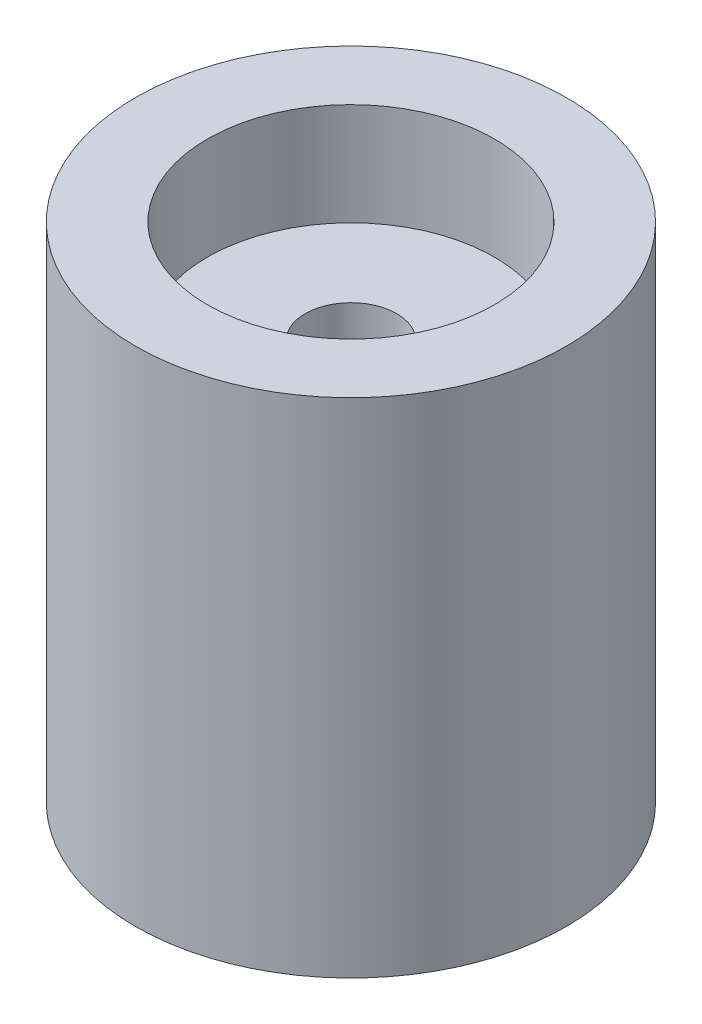
ISO-10303-21;
HEADER;
FILE_DESCRIPTION(('STEP AP214'),'2;1');
FILE_NAME('part.step','',(''),(''),'','','');
FILE_SCHEMA(('AUTOMOTIVE_DESIGN { 1 0 10303 214 1 1 1 1 }'));
ENDSEC;
DATA;
#1=APPLICATION_CONTEXT('core data for automotive mechanical design processes');
#2=APPLICATION_PROTOCOL_DEFINITION('international standard','automotive_design',2000,#1);
#3=PRODUCT_CONTEXT('',#1,'mechanical');
#4=PRODUCT('Part','Part','',(#3));
#5=PRODUCT_RELATED_PRODUCT_CATEGORY('part','',(#4));
#6=PRODUCT_DEFINITION_FORMATION('','',#4);
#7=PRODUCT_DEFINITION_CONTEXT('part definition',#1,'design');
#8=PRODUCT_DEFINITION('design','',#6,#7);
#9=PRODUCT_DEFINITION_SHAPE('','',#8);
#10=(LENGTH_UNIT() NAMED_UNIT(*) SI_UNIT(.MILLI.,.METRE.));
#11=(NAMED_UNIT(*) PLANE_ANGLE_UNIT() SI_UNIT($,.RADIAN.));
#12=(NAMED_UNIT(*) SI_UNIT($,.STERADIAN.) SOLID_ANGLE_UNIT());
#13=UNCERTAINTY_MEASURE_WITH_UNIT(LENGTH_MEASURE(1.E-05),#10,'distance_accuracy_value','');
#14=(GEOMETRIC_REPRESENTATION_CONTEXT(3) GLOBAL_UNCERTAINTY_ASSIGNED_CONTEXT((#13)) GLOBAL_UNIT_ASSIGNED_CONTEXT((#10,
#11,#12)) REPRESENTATION_CONTEXT('',''));
#15=CARTESIAN_POINT('',(0.,0.,0.));
#16=DIRECTION('',(0.,0.,1.));
#17=DIRECTION('',(1.,0.,0.));
#18=AXIS2_PLACEMENT_3D('',#15,#16,#17);
#19=CARTESIAN_POINT('',(0.,14.,0.));
#20=DIRECTION('',(0.,-1.,0.));
#21=DIRECTION('',(0.,0.,-1.));
#22=AXIS2_PLACEMENT_3D('',#19,#20,#21);
#23=CYLINDRICAL_SURFACE('',#22,6.);
#24=CARTESIAN_POINT('',(0.,14.,0.));
#25=DIRECTION('',(0.,1.,0.));
#26=DIRECTION('',(0.,0.,1.));
#27=AXIS2_PLACEMENT_3D('',#24,#25,#26);
#28=CIRCLE('',#27,6.);
#29=CARTESIAN_POINT('',(0.,14.,6.));
#30=VERTEX_POINT('',#29);
#31=EDGE_CURVE('E10',#30,#30,#28,.T.);
#32=ORIENTED_EDGE('',*,*,#31,.F.);
#33=EDGE_LOOP('',(#32));
#34=FACE_BOUND('',#33,.T.);
#35=CARTESIAN_POINT('',(0.,0.,0.));
#36=DIRECTION('',(0.,1.,0.));
#37=DIRECTION('',(0.,0.,1.));
#38=AXIS2_PLACEMENT_3D('',#35,#36,#37);
#39=CIRCLE('',#38,6.);
#40=CARTESIAN_POINT('',(0.,0.,6.));
#41=VERTEX_POINT('',#40);
#42=EDGE_CURVE('E40',#41,#41,#39,.T.);
#43=ORIENTED_EDGE('',*,*,#42,.T.);
#44=EDGE_LOOP('',(#43));
#45=FACE_BOUND('',#44,.T.);
#46=ADVANCED_FACE('F37',(#34,#45),#23,.T.);
#47=CARTESIAN_POINT('',(0.,14.,0.));
#48=DIRECTION('',(0.,1.,0.));
#49=DIRECTION('',(0.,0.,1.));
#50=AXIS2_PLACEMENT_3D('',#47,#48,#49);
#51=PLANE('',#50);
#52=CARTESIAN_POINT('',(0.,14.,0.));
#53=DIRECTION('',(0.,1.,0.));
#54=DIRECTION('',(0.,0.,1.));
#55=AXIS2_PLACEMENT_3D('',#52,#53,#54);
#56=CIRCLE('',#55,4.);
#57=CARTESIAN_POINT('',(0.,14.,4.));
#58=VERTEX_POINT('',#57);
#59=EDGE_CURVE('E70',#58,#58,#56,.T.);
#60=ORIENTED_EDGE('',*,*,#59,.F.);
#61=EDGE_LOOP('',(#60));
#62=FACE_BOUND('',#61,.T.);
#63=ORIENTED_EDGE('',*,*,#31,.T.);
#64=EDGE_LOOP('',(#63));
#65=FACE_BOUND('',#64,.T.);
#66=ADVANCED_FACE('F77',(#62,#65),#51,.T.);
#67=CARTESIAN_POINT('',(0.,0.,0.));
#68=DIRECTION('',(0.,1.,0.));
#69=DIRECTION('',(0.,0.,1.));
#70=AXIS2_PLACEMENT_3D('',#67,#68,#69);
#71=PLANE('',#70);
#72=CARTESIAN_POINT('',(0.,0.,0.));
#73=DIRECTION('',(0.,1.,0.));
#74=DIRECTION('',(0.,0.,1.));
#75=AXIS2_PLACEMENT_3D('',#72,#73,#74);
#76=CIRCLE('',#75,2.275);
#77=CARTESIAN_POINT('',(0.,0.,2.275));
#78=VERTEX_POINT('',#77);
#79=EDGE_CURVE('E51',#78,#78,#76,.T.);
#80=ORIENTED_EDGE('',*,*,#79,.T.);
#81=EDGE_LOOP('',(#80));
#82=FACE_BOUND('',#81,.T.);
#83=ORIENTED_EDGE('',*,*,#42,.F.);
#84=EDGE_LOOP('',(#83));
#85=FACE_BOUND('',#84,.T.);
#86=ADVANCED_FACE('F79',(#82,#85),#71,.F.);
#87=CARTESIAN_POINT('',(0.,3.9,0.));
#88=DIRECTION('',(0.,-1.,0.));
#89=DIRECTION('',(0.,0.,-1.));
#90=AXIS2_PLACEMENT_3D('',#87,#88,#89);
#91=CYLINDRICAL_SURFACE('',#90,2.275);
#92=CARTESIAN_POINT('',(0.,3.9,0.));
#93=DIRECTION('',(0.,1.,0.));
#94=DIRECTION('',(0.,0.,1.));
#95=AXIS2_PLACEMENT_3D('',#92,#93,#94);
#96=CIRCLE('',#95,2.275);
#97=CARTESIAN_POINT('',(0.,3.9,2.275));
#98=VERTEX_POINT('',#97);
#99=EDGE_CURVE('E49',#98,#98,#96,.T.);
#100=ORIENTED_EDGE('',*,*,#99,.T.);
#101=EDGE_LOOP('',(#100));
#102=FACE_BOUND('',#101,.T.);
#103=ORIENTED_EDGE('',*,*,#79,.F.);
#104=EDGE_LOOP('',(#103));
#105=FACE_BOUND('',#104,.T.);
#106=ADVANCED_FACE('F85',(#102,#105),#91,.F.);
#107=CARTESIAN_POINT('',(0.,3.9,0.));
#108=DIRECTION('',(0.,1.,0.));
#109=DIRECTION('',(0.,0.,1.));
#110=AXIS2_PLACEMENT_3D('',#107,#108,#109);
#111=PLANE('',#110);
#112=CARTESIAN_POINT('',(0.,3.9,0.));
#113=DIRECTION('',(0.,1.,0.));
#114=DIRECTION('',(0.,0.,1.));
#115=AXIS2_PLACEMENT_3D('',#112,#113,#114);
#116=CIRCLE('',#115,1.275);
#117=CARTESIAN_POINT('',(0.,3.9,1.275));
#118=VERTEX_POINT('',#117);
#119=EDGE_CURVE('E55',#118,#118,#116,.T.);
#120=ORIENTED_EDGE('',*,*,#119,.T.);
#121=EDGE_LOOP('',(#120));
#122=FACE_BOUND('',#121,.T.);
#123=ORIENTED_EDGE('',*,*,#99,.F.);
#124=EDGE_LOOP('',(#123));
#125=FACE_BOUND('',#124,.T.);
#126=ADVANCED_FACE('F91',(#122,#125),#111,.F.);
#127=CARTESIAN_POINT('',(0.,14.,0.));
#128=DIRECTION('',(0.,1.,0.));
#129=DIRECTION('',(0.,0.,1.));
#130=AXIS2_PLACEMENT_3D('',#127,#128,#129);
#131=CYLINDRICAL_SURFACE('',#130,1.275);
#132=ORIENTED_EDGE('',*,*,#119,.F.);
#133=EDGE_LOOP('',(#132));
#134=FACE_BOUND('',#133,.T.);
#135=CARTESIAN_POINT('',(0.,11.149,0.));
#136=DIRECTION('',(0.,1.,0.));
#137=DIRECTION('',(0.,0.,1.));
#138=AXIS2_PLACEMENT_3D('',#135,#136,#137);
#139=CIRCLE('',#138,1.275);
#140=CARTESIAN_POINT('',(0.,11.149,1.275));
#141=VERTEX_POINT('',#140);
#142=EDGE_CURVE('E62',#141,#141,#139,.T.);
#143=ORIENTED_EDGE('',*,*,#142,.T.);
#144=EDGE_LOOP('',(#143));
#145=FACE_BOUND('',#144,.T.);
#146=ADVANCED_FACE('F95',(#134,#145),#131,.F.);
#147=CARTESIAN_POINT('',(1.275,11.149,0.));
#148=DIRECTION('',(0.,-1.,0.));
#149=DIRECTION('',(0.,0.,-1.));
#150=AXIS2_PLACEMENT_3D('',#147,#148,#149);
#151=PLANE('',#150);
#152=ORIENTED_EDGE('',*,*,#142,.F.);
#153=EDGE_LOOP('',(#152));
#154=FACE_BOUND('',#153,.T.);
#155=CARTESIAN_POINT('',(0.,11.149,0.));
#156=DIRECTION('',(0.,1.,0.));
#157=DIRECTION('',(0.,0.,1.));
#158=AXIS2_PLACEMENT_3D('',#155,#156,#157);
#159=CIRCLE('',#158,4.);
#160=CARTESIAN_POINT('',(0.,11.149,4.));
#161=VERTEX_POINT('',#160);
#162=EDGE_CURVE('E66',#161,#161,#159,.T.);
#163=ORIENTED_EDGE('',*,*,#162,.T.);
#164=EDGE_LOOP('',(#163));
#165=FACE_BOUND('',#164,.T.);
#166=ADVANCED_FACE('F99',(#154,#165),#151,.F.);
#167=CARTESIAN_POINT('',(0.,14.,0.));
#168=DIRECTION('',(0.,1.,0.));
#169=DIRECTION('',(0.,0.,1.));
#170=AXIS2_PLACEMENT_3D('',#167,#168,#169);
#171=CYLINDRICAL_SURFACE('',#170,4.);
#172=ORIENTED_EDGE('',*,*,#162,.F.);
#173=EDGE_LOOP('',(#172));
#174=FACE_BOUND('',#173,.T.);
#175=ORIENTED_EDGE('',*,*,#59,.T.);
#176=EDGE_LOOP('',(#175));
#177=FACE_BOUND('',#176,.T.);
#178=ADVANCED_FACE('F75',(#174,#177),#171,.F.);
#179=CLOSED_SHELL('',(#46,#66,#86,#106,#126,#146,#166,#178));
#180=MANIFOLD_SOLID_BREP('B2',#179);
#181=ADVANCED_BREP_SHAPE_REPRESENTATION('',(#18,#180),#14);
#182=SHAPE_DEFINITION_REPRESENTATION(#9,#181);
ENDSEC;
END-ISO-10303-21;
